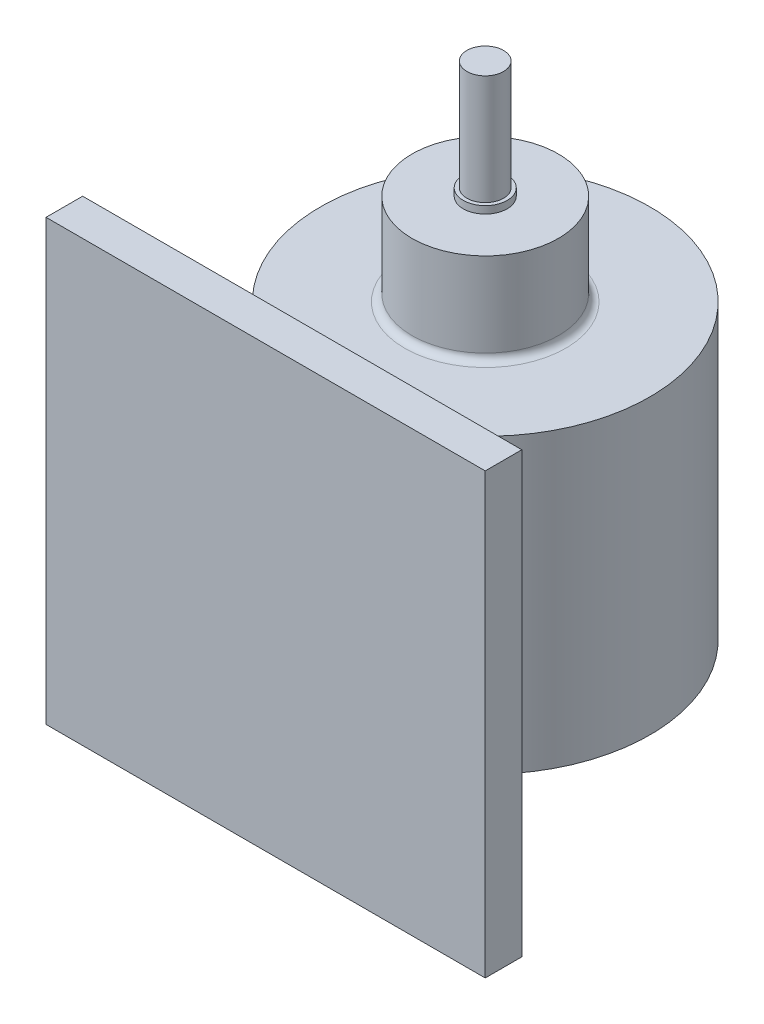
ISO-10303-21;
HEADER;
FILE_DESCRIPTION(('STEP AP214'),'2;1');
FILE_NAME('part.step','',(''),(''),'','','');
FILE_SCHEMA(('AUTOMOTIVE_DESIGN { 1 0 10303 214 1 1 1 1 }'));
ENDSEC;
DATA;
#1=APPLICATION_CONTEXT('core data for automotive mechanical design processes');
#2=APPLICATION_PROTOCOL_DEFINITION('international standard','automotive_design',2000,#1);
#3=PRODUCT_CONTEXT('',#1,'mechanical');
#4=PRODUCT('Part','Part','',(#3));
#5=PRODUCT_RELATED_PRODUCT_CATEGORY('part','',(#4));
#6=PRODUCT_DEFINITION_FORMATION('','',#4);
#7=PRODUCT_DEFINITION_CONTEXT('part definition',#1,'design');
#8=PRODUCT_DEFINITION('design','',#6,#7);
#9=PRODUCT_DEFINITION_SHAPE('','',#8);
#10=(LENGTH_UNIT() NAMED_UNIT(*) SI_UNIT(.MILLI.,.METRE.));
#11=(NAMED_UNIT(*) PLANE_ANGLE_UNIT() SI_UNIT($,.RADIAN.));
#12=(NAMED_UNIT(*) SI_UNIT($,.STERADIAN.) SOLID_ANGLE_UNIT());
#13=UNCERTAINTY_MEASURE_WITH_UNIT(LENGTH_MEASURE(1.E-05),#10,'distance_accuracy_value','');
#14=(GEOMETRIC_REPRESENTATION_CONTEXT(3) GLOBAL_UNCERTAINTY_ASSIGNED_CONTEXT((#13)) GLOBAL_UNIT_ASSIGNED_CONTEXT((#10,
#11,#12)) REPRESENTATION_CONTEXT('',''));
#15=CARTESIAN_POINT('',(0.,0.,0.));
#16=DIRECTION('',(0.,0.,1.));
#17=DIRECTION('',(1.,0.,0.));
#18=AXIS2_PLACEMENT_3D('',#15,#16,#17);
#19=CARTESIAN_POINT('',(0.,40.,-50.));
#20=DIRECTION('',(0.,-1.,0.));
#21=DIRECTION('',(0.,0.,-1.));
#22=AXIS2_PLACEMENT_3D('',#19,#20,#21);
#23=CYLINDRICAL_SURFACE('',#22,45.);
#24=DIRECTION('',(0.,-1.,0.));
#25=VECTOR('',#24,1.);
#26=CARTESIAN_POINT('',(20.,40.,-9.68871125850724));
#27=LINE('',#26,#25);
#28=CARTESIAN_POINT('',(20.,40.,-9.68871125850724));
#29=VERTEX_POINT('',#28);
#30=CARTESIAN_POINT('',(20.,-40.,-9.68871125850724));
#31=VERTEX_POINT('',#30);
#32=EDGE_CURVE('E256',#29,#31,#27,.T.);
#33=ORIENTED_EDGE('',*,*,#32,.F.);
#34=CARTESIAN_POINT('',(0.,40.,-50.));
#35=DIRECTION('',(0.,1.,0.));
#36=DIRECTION('',(0.,0.,1.));
#37=AXIS2_PLACEMENT_3D('',#34,#35,#36);
#38=CIRCLE('',#37,45.);
#39=CARTESIAN_POINT('',(-20.,40.,-9.68871125850724));
#40=VERTEX_POINT('',#39);
#41=EDGE_CURVE('E59',#40,#29,#38,.T.);
#42=ORIENTED_EDGE('',*,*,#41,.F.);
#43=DIRECTION('',(0.,-1.,0.));
#44=VECTOR('',#43,1.);
#45=CARTESIAN_POINT('',(-20.,40.,-9.68871125850724));
#46=LINE('',#45,#44);
#47=CARTESIAN_POINT('',(-20.,-40.,-9.68871125850724));
#48=VERTEX_POINT('',#47);
#49=EDGE_CURVE('E247',#48,#40,#46,.F.);
#50=ORIENTED_EDGE('',*,*,#49,.F.);
#51=CARTESIAN_POINT('',(0.,-40.,-50.));
#52=DIRECTION('',(0.,1.,0.));
#53=DIRECTION('',(0.,0.,1.));
#54=AXIS2_PLACEMENT_3D('',#51,#52,#53);
#55=CIRCLE('',#54,45.);
#56=EDGE_CURVE('E264',#48,#31,#55,.T.);
#57=ORIENTED_EDGE('',*,*,#56,.T.);
#58=EDGE_LOOP('',(#33,#42,#50,#57));
#59=FACE_BOUND('',#58,.T.);
#60=ADVANCED_FACE('F41',(#59),#23,.T.);
#61=DIRECTION('',(0.,-1.,0.));
#62=VECTOR('',#61,1.);
#63=CARTESIAN_POINT('',(30.,40.,-16.4589803375031));
#64=LINE('',#63,#62);
#65=CARTESIAN_POINT('',(30.,-40.,-16.4589803375031));
#66=VERTEX_POINT('',#65);
#67=CARTESIAN_POINT('',(30.,40.,-16.4589803375031));
#68=VERTEX_POINT('',#67);
#69=EDGE_CURVE('E252',#66,#68,#64,.F.);
#70=ORIENTED_EDGE('',*,*,#69,.F.);
#71=CARTESIAN_POINT('',(-30.,-40.,-16.4589803375031));
#72=VERTEX_POINT('',#71);
#73=EDGE_CURVE('E267',#66,#72,#55,.T.);
#74=ORIENTED_EDGE('',*,*,#73,.T.);
#75=DIRECTION('',(0.,-1.,0.));
#76=VECTOR('',#75,1.);
#77=CARTESIAN_POINT('',(-30.,40.,-16.4589803375031));
#78=LINE('',#77,#76);
#79=CARTESIAN_POINT('',(-30.,40.,-16.4589803375031));
#80=VERTEX_POINT('',#79);
#81=EDGE_CURVE('E67',#80,#72,#78,.T.);
#82=ORIENTED_EDGE('',*,*,#81,.F.);
#83=EDGE_CURVE('E142',#68,#80,#38,.T.);
#84=ORIENTED_EDGE('',*,*,#83,.F.);
#85=EDGE_LOOP('',(#70,#74,#82,#84));
#86=FACE_BOUND('',#85,.T.);
#87=ADVANCED_FACE('F279',(#86),#23,.T.);
#88=CARTESIAN_POINT('',(0.,40.,-50.));
#89=DIRECTION('',(0.,1.,0.));
#90=DIRECTION('',(0.,0.,1.));
#91=AXIS2_PLACEMENT_3D('',#88,#89,#90);
#92=PLANE('',#91);
#93=CARTESIAN_POINT('',(0.,40.,-50.));
#94=DIRECTION('',(0.,1.,0.));
#95=DIRECTION('',(0.,0.,1.));
#96=AXIS2_PLACEMENT_3D('',#93,#94,#95);
#97=CIRCLE('',#96,22.);
#98=CARTESIAN_POINT('',(0.,40.,-28.));
#99=VERTEX_POINT('',#98);
#100=EDGE_CURVE('E45',#99,#99,#97,.F.);
#101=ORIENTED_EDGE('',*,*,#100,.T.);
#102=EDGE_LOOP('',(#101));
#103=FACE_BOUND('',#102,.T.);
#104=ORIENTED_EDGE('',*,*,#41,.T.);
#105=DIRECTION('',(0.,0.,1.));
#106=VECTOR('',#105,1.);
#107=CARTESIAN_POINT('',(20.,40.,-50.));
#108=LINE('',#107,#106);
#109=CARTESIAN_POINT('',(20.,40.,0.));
#110=VERTEX_POINT('',#109);
#111=EDGE_CURVE('E202',#29,#110,#108,.T.);
#112=ORIENTED_EDGE('',*,*,#111,.T.);
#113=DIRECTION('',(1.,0.,0.));
#114=VECTOR('',#113,1.);
#115=CARTESIAN_POINT('',(30.,40.,0.));
#116=LINE('',#115,#114);
#117=CARTESIAN_POINT('',(30.,40.,0.));
#118=VERTEX_POINT('',#117);
#119=EDGE_CURVE('E181',#110,#118,#116,.T.);
#120=ORIENTED_EDGE('',*,*,#119,.T.);
#121=DIRECTION('',(0.,0.,1.));
#122=VECTOR('',#121,1.);
#123=CARTESIAN_POINT('',(30.,40.,-50.));
#124=LINE('',#123,#122);
#125=EDGE_CURVE('E199',#68,#118,#124,.T.);
#126=ORIENTED_EDGE('',*,*,#125,.F.);
#127=ORIENTED_EDGE('',*,*,#83,.T.);
#128=DIRECTION('',(0.,0.,1.));
#129=VECTOR('',#128,1.);
#130=CARTESIAN_POINT('',(-30.,40.,-50.));
#131=LINE('',#130,#129);
#132=CARTESIAN_POINT('',(-30.,40.,0.));
#133=VERTEX_POINT('',#132);
#134=EDGE_CURVE('E134',#80,#133,#131,.T.);
#135=ORIENTED_EDGE('',*,*,#134,.T.);
#136=DIRECTION('',(1.,0.,0.));
#137=VECTOR('',#136,1.);
#138=CARTESIAN_POINT('',(-30.,40.,0.));
#139=LINE('',#138,#137);
#140=CARTESIAN_POINT('',(-20.,40.,0.));
#141=VERTEX_POINT('',#140);
#142=EDGE_CURVE('E139',#133,#141,#139,.T.);
#143=ORIENTED_EDGE('',*,*,#142,.T.);
#144=DIRECTION('',(0.,0.,1.));
#145=VECTOR('',#144,1.);
#146=CARTESIAN_POINT('',(-20.,40.,-50.));
#147=LINE('',#146,#145);
#148=EDGE_CURVE('E146',#40,#141,#147,.T.);
#149=ORIENTED_EDGE('',*,*,#148,.F.);
#150=EDGE_LOOP('',(#104,#112,#120,#126,#127,#135,#143,#149));
#151=FACE_BOUND('',#150,.T.);
#152=ADVANCED_FACE('F136',(#103,#151),#92,.T.);
#153=CARTESIAN_POINT('',(0.,-40.,-50.));
#154=DIRECTION('',(0.,1.,0.));
#155=DIRECTION('',(0.,0.,1.));
#156=AXIS2_PLACEMENT_3D('',#153,#154,#155);
#157=PLANE('',#156);
#158=ORIENTED_EDGE('',*,*,#73,.F.);
#159=DIRECTION('',(0.,0.,1.));
#160=VECTOR('',#159,1.);
#161=CARTESIAN_POINT('',(30.,-40.,-50.));
#162=LINE('',#161,#160);
#163=CARTESIAN_POINT('',(30.,-40.,0.));
#164=VERTEX_POINT('',#163);
#165=EDGE_CURVE('E196',#66,#164,#162,.T.);
#166=ORIENTED_EDGE('',*,*,#165,.T.);
#167=DIRECTION('',(-1.,0.,0.));
#168=VECTOR('',#167,1.);
#169=CARTESIAN_POINT('',(30.,-40.,0.));
#170=LINE('',#169,#168);
#171=CARTESIAN_POINT('',(20.,-40.,0.));
#172=VERTEX_POINT('',#171);
#173=EDGE_CURVE('E189',#164,#172,#170,.T.);
#174=ORIENTED_EDGE('',*,*,#173,.T.);
#175=DIRECTION('',(0.,0.,1.));
#176=VECTOR('',#175,1.);
#177=CARTESIAN_POINT('',(20.,-40.,-50.));
#178=LINE('',#177,#176);
#179=EDGE_CURVE('E193',#31,#172,#178,.T.);
#180=ORIENTED_EDGE('',*,*,#179,.F.);
#181=ORIENTED_EDGE('',*,*,#56,.F.);
#182=DIRECTION('',(0.,0.,1.));
#183=VECTOR('',#182,1.);
#184=CARTESIAN_POINT('',(-20.,-40.,-50.));
#185=LINE('',#184,#183);
#186=CARTESIAN_POINT('',(-20.,-40.,0.));
#187=VERTEX_POINT('',#186);
#188=EDGE_CURVE('E173',#48,#187,#185,.T.);
#189=ORIENTED_EDGE('',*,*,#188,.T.);
#190=DIRECTION('',(-1.,0.,0.));
#191=VECTOR('',#190,1.);
#192=CARTESIAN_POINT('',(-30.,-40.,0.));
#193=LINE('',#192,#191);
#194=CARTESIAN_POINT('',(-30.,-40.,0.));
#195=VERTEX_POINT('',#194);
#196=EDGE_CURVE('E165',#187,#195,#193,.T.);
#197=ORIENTED_EDGE('',*,*,#196,.T.);
#198=DIRECTION('',(0.,0.,1.));
#199=VECTOR('',#198,1.);
#200=CARTESIAN_POINT('',(-30.,-40.,-50.));
#201=LINE('',#200,#199);
#202=EDGE_CURVE('E152',#72,#195,#201,.T.);
#203=ORIENTED_EDGE('',*,*,#202,.F.);
#204=EDGE_LOOP('',(#158,#166,#174,#180,#181,#189,#197,#203));
#205=FACE_BOUND('',#204,.T.);
#206=ADVANCED_FACE('F282',(#205),#157,.F.);
#207=CARTESIAN_POINT('',(0.,65.,-50.));
#208=DIRECTION('',(0.,-1.,0.));
#209=DIRECTION('',(0.,0.,-1.));
#210=AXIS2_PLACEMENT_3D('',#207,#208,#209);
#211=CYLINDRICAL_SURFACE('',#210,20.);
#212=CARTESIAN_POINT('',(0.,42.,-50.));
#213=DIRECTION('',(0.,1.,0.));
#214=DIRECTION('',(0.,0.,1.));
#215=AXIS2_PLACEMENT_3D('',#212,#213,#214);
#216=CIRCLE('',#215,20.);
#217=CARTESIAN_POINT('',(0.,42.,-30.));
#218=VERTEX_POINT('',#217);
#219=EDGE_CURVE('E269',#218,#218,#216,.T.);
#220=ORIENTED_EDGE('',*,*,#219,.T.);
#221=EDGE_LOOP('',(#220));
#222=FACE_BOUND('',#221,.T.);
#223=CARTESIAN_POINT('',(0.,65.,-50.));
#224=DIRECTION('',(0.,1.,0.));
#225=DIRECTION('',(0.,0.,1.));
#226=AXIS2_PLACEMENT_3D('',#223,#224,#225);
#227=CIRCLE('',#226,20.);
#228=CARTESIAN_POINT('',(0.,65.,-30.));
#229=VERTEX_POINT('',#228);
#230=EDGE_CURVE('E260',#229,#229,#227,.T.);
#231=ORIENTED_EDGE('',*,*,#230,.F.);
#232=EDGE_LOOP('',(#231));
#233=FACE_BOUND('',#232,.T.);
#234=ADVANCED_FACE('F313',(#222,#233),#211,.T.);
#235=CARTESIAN_POINT('',(0.,65.,-50.));
#236=DIRECTION('',(0.,1.,0.));
#237=DIRECTION('',(0.,0.,1.));
#238=AXIS2_PLACEMENT_3D('',#235,#236,#237);
#239=PLANE('',#238);
#240=CARTESIAN_POINT('',(0.,65.,-50.));
#241=DIRECTION('',(0.,1.,0.));
#242=DIRECTION('',(0.,0.,1.));
#243=AXIS2_PLACEMENT_3D('',#240,#241,#242);
#244=CIRCLE('',#243,6.);
#245=CARTESIAN_POINT('',(0.,65.,-44.));
#246=VERTEX_POINT('',#245);
#247=EDGE_CURVE('E51',#246,#246,#244,.T.);
#248=ORIENTED_EDGE('',*,*,#247,.F.);
#249=EDGE_LOOP('',(#248));
#250=FACE_BOUND('',#249,.T.);
#251=ORIENTED_EDGE('',*,*,#230,.T.);
#252=EDGE_LOOP('',(#251));
#253=FACE_BOUND('',#252,.T.);
#254=ADVANCED_FACE('F304',(#250,#253),#239,.T.);
#255=CARTESIAN_POINT('',(20.,-40.,-50.));
#256=DIRECTION('',(1.,0.,0.));
#257=DIRECTION('',(0.,0.,-1.));
#258=AXIS2_PLACEMENT_3D('',#255,#256,#257);
#259=PLANE('',#258);
#260=ORIENTED_EDGE('',*,*,#111,.F.);
#261=ORIENTED_EDGE('',*,*,#32,.T.);
#262=ORIENTED_EDGE('',*,*,#179,.T.);
#263=DIRECTION('',(0.,1.,0.));
#264=VECTOR('',#263,1.);
#265=CARTESIAN_POINT('',(20.,-40.,0.));
#266=LINE('',#265,#264);
#267=EDGE_CURVE('E145',#172,#110,#266,.T.);
#268=ORIENTED_EDGE('',*,*,#267,.T.);
#269=EDGE_LOOP('',(#260,#261,#262,#268));
#270=FACE_BOUND('',#269,.T.);
#271=ADVANCED_FACE('F289',(#270),#259,.F.);
#272=CARTESIAN_POINT('',(30.,-40.,-50.));
#273=DIRECTION('',(-1.,0.,0.));
#274=DIRECTION('',(0.,0.,1.));
#275=AXIS2_PLACEMENT_3D('',#272,#273,#274);
#276=PLANE('',#275);
#277=ORIENTED_EDGE('',*,*,#165,.F.);
#278=ORIENTED_EDGE('',*,*,#69,.T.);
#279=ORIENTED_EDGE('',*,*,#125,.T.);
#280=DIRECTION('',(0.,-1.,0.));
#281=VECTOR('',#280,1.);
#282=CARTESIAN_POINT('',(30.,-40.,0.));
#283=LINE('',#282,#281);
#284=EDGE_CURVE('E185',#118,#164,#283,.T.);
#285=ORIENTED_EDGE('',*,*,#284,.T.);
#286=EDGE_LOOP('',(#277,#278,#279,#285));
#287=FACE_BOUND('',#286,.T.);
#288=ADVANCED_FACE('F296',(#287),#276,.F.);
#289=CARTESIAN_POINT('',(-30.,-40.,-50.));
#290=DIRECTION('',(1.,0.,0.));
#291=DIRECTION('',(0.,0.,-1.));
#292=AXIS2_PLACEMENT_3D('',#289,#290,#291);
#293=PLANE('',#292);
#294=ORIENTED_EDGE('',*,*,#134,.F.);
#295=ORIENTED_EDGE('',*,*,#81,.T.);
#296=ORIENTED_EDGE('',*,*,#202,.T.);
#297=DIRECTION('',(0.,1.,0.));
#298=VECTOR('',#297,1.);
#299=CARTESIAN_POINT('',(-30.,-40.,0.));
#300=LINE('',#299,#298);
#301=EDGE_CURVE('E149',#195,#133,#300,.T.);
#302=ORIENTED_EDGE('',*,*,#301,.T.);
#303=EDGE_LOOP('',(#294,#295,#296,#302));
#304=FACE_BOUND('',#303,.T.);
#305=ADVANCED_FACE('F150',(#304),#293,.F.);
#306=CARTESIAN_POINT('',(-20.,-40.,-50.));
#307=DIRECTION('',(-1.,0.,0.));
#308=DIRECTION('',(0.,0.,1.));
#309=AXIS2_PLACEMENT_3D('',#306,#307,#308);
#310=PLANE('',#309);
#311=ORIENTED_EDGE('',*,*,#188,.F.);
#312=ORIENTED_EDGE('',*,*,#49,.T.);
#313=ORIENTED_EDGE('',*,*,#148,.T.);
#314=DIRECTION('',(0.,-1.,0.));
#315=VECTOR('',#314,1.);
#316=CARTESIAN_POINT('',(-20.,-40.,0.));
#317=LINE('',#316,#315);
#318=EDGE_CURVE('E161',#141,#187,#317,.T.);
#319=ORIENTED_EDGE('',*,*,#318,.T.);
#320=EDGE_LOOP('',(#311,#312,#313,#319));
#321=FACE_BOUND('',#320,.T.);
#322=ADVANCED_FACE('F286',(#321),#310,.F.);
#323=CARTESIAN_POINT('',(0.,0.,0.));
#324=DIRECTION('',(0.,0.,-1.));
#325=DIRECTION('',(-1.,0.,0.));
#326=AXIS2_PLACEMENT_3D('',#323,#324,#325);
#327=PLANE('',#326);
#328=DIRECTION('',(0.,1.,0.));
#329=VECTOR('',#328,1.);
#330=CARTESIAN_POINT('',(60.,-60.,0.));
#331=LINE('',#330,#329);
#332=CARTESIAN_POINT('',(60.,-60.,0.));
#333=VERTEX_POINT('',#332);
#334=CARTESIAN_POINT('',(60.,60.,0.));
#335=VERTEX_POINT('',#334);
#336=EDGE_CURVE('E205',#333,#335,#331,.T.);
#337=ORIENTED_EDGE('',*,*,#336,.F.);
#338=DIRECTION('',(1.,0.,0.));
#339=VECTOR('',#338,1.);
#340=CARTESIAN_POINT('',(-60.,-60.,0.));
#341=LINE('',#340,#339);
#342=CARTESIAN_POINT('',(-60.,-60.,0.));
#343=VERTEX_POINT('',#342);
#344=EDGE_CURVE('E211',#343,#333,#341,.T.);
#345=ORIENTED_EDGE('',*,*,#344,.F.);
#346=DIRECTION('',(0.,-1.,0.));
#347=VECTOR('',#346,1.);
#348=CARTESIAN_POINT('',(-60.,-60.,0.));
#349=LINE('',#348,#347);
#350=CARTESIAN_POINT('',(-60.,60.,0.));
#351=VERTEX_POINT('',#350);
#352=EDGE_CURVE('E227',#351,#343,#349,.T.);
#353=ORIENTED_EDGE('',*,*,#352,.F.);
#354=DIRECTION('',(-1.,0.,0.));
#355=VECTOR('',#354,1.);
#356=CARTESIAN_POINT('',(-60.,60.,0.));
#357=LINE('',#356,#355);
#358=EDGE_CURVE('E224',#335,#351,#357,.T.);
#359=ORIENTED_EDGE('',*,*,#358,.F.);
#360=EDGE_LOOP('',(#337,#345,#353,#359));
#361=FACE_BOUND('',#360,.T.);
#362=ORIENTED_EDGE('',*,*,#119,.F.);
#363=ORIENTED_EDGE('',*,*,#267,.F.);
#364=ORIENTED_EDGE('',*,*,#173,.F.);
#365=ORIENTED_EDGE('',*,*,#284,.F.);
#366=EDGE_LOOP('',(#362,#363,#364,#365));
#367=FACE_BOUND('',#366,.T.);
#368=ORIENTED_EDGE('',*,*,#142,.F.);
#369=ORIENTED_EDGE('',*,*,#301,.F.);
#370=ORIENTED_EDGE('',*,*,#196,.F.);
#371=ORIENTED_EDGE('',*,*,#318,.F.);
#372=EDGE_LOOP('',(#368,#369,#370,#371));
#373=FACE_BOUND('',#372,.T.);
#374=ADVANCED_FACE('F159',(#361,#367,#373),#327,.T.);
#375=CARTESIAN_POINT('',(60.,-60.,10.));
#376=DIRECTION('',(-1.,0.,0.));
#377=DIRECTION('',(0.,0.,1.));
#378=AXIS2_PLACEMENT_3D('',#375,#376,#377);
#379=PLANE('',#378);
#380=ORIENTED_EDGE('',*,*,#336,.T.);
#381=DIRECTION('',(0.,0.,-1.));
#382=VECTOR('',#381,1.);
#383=CARTESIAN_POINT('',(60.,60.,10.));
#384=LINE('',#383,#382);
#385=CARTESIAN_POINT('',(60.,60.,10.));
#386=VERTEX_POINT('',#385);
#387=EDGE_CURVE('E243',#386,#335,#384,.T.);
#388=ORIENTED_EDGE('',*,*,#387,.F.);
#389=DIRECTION('',(0.,1.,0.));
#390=VECTOR('',#389,1.);
#391=CARTESIAN_POINT('',(60.,-60.,10.));
#392=LINE('',#391,#390);
#393=CARTESIAN_POINT('',(60.,-60.,10.));
#394=VERTEX_POINT('',#393);
#395=EDGE_CURVE('E206',#394,#386,#392,.T.);
#396=ORIENTED_EDGE('',*,*,#395,.F.);
#397=DIRECTION('',(0.,0.,-1.));
#398=VECTOR('',#397,1.);
#399=CARTESIAN_POINT('',(60.,-60.,10.));
#400=LINE('',#399,#398);
#401=EDGE_CURVE('E220',#394,#333,#400,.T.);
#402=ORIENTED_EDGE('',*,*,#401,.T.);
#403=EDGE_LOOP('',(#380,#388,#396,#402));
#404=FACE_BOUND('',#403,.T.);
#405=ADVANCED_FACE('F322',(#404),#379,.F.);
#406=CARTESIAN_POINT('',(-60.,60.,10.));
#407=DIRECTION('',(0.,-1.,0.));
#408=DIRECTION('',(0.,0.,-1.));
#409=AXIS2_PLACEMENT_3D('',#406,#407,#408);
#410=PLANE('',#409);
#411=ORIENTED_EDGE('',*,*,#358,.T.);
#412=DIRECTION('',(0.,0.,-1.));
#413=VECTOR('',#412,1.);
#414=CARTESIAN_POINT('',(-60.,60.,10.));
#415=LINE('',#414,#413);
#416=CARTESIAN_POINT('',(-60.,60.,10.));
#417=VERTEX_POINT('',#416);
#418=EDGE_CURVE('E239',#417,#351,#415,.T.);
#419=ORIENTED_EDGE('',*,*,#418,.F.);
#420=DIRECTION('',(-1.,0.,0.));
#421=VECTOR('',#420,1.);
#422=CARTESIAN_POINT('',(-60.,60.,10.));
#423=LINE('',#422,#421);
#424=EDGE_CURVE('E210',#386,#417,#423,.T.);
#425=ORIENTED_EDGE('',*,*,#424,.F.);
#426=ORIENTED_EDGE('',*,*,#387,.T.);
#427=EDGE_LOOP('',(#411,#419,#425,#426));
#428=FACE_BOUND('',#427,.T.);
#429=ADVANCED_FACE('F325',(#428),#410,.F.);
#430=CARTESIAN_POINT('',(-60.,-60.,10.));
#431=DIRECTION('',(1.,0.,0.));
#432=DIRECTION('',(0.,0.,-1.));
#433=AXIS2_PLACEMENT_3D('',#430,#431,#432);
#434=PLANE('',#433);
#435=ORIENTED_EDGE('',*,*,#352,.T.);
#436=DIRECTION('',(0.,0.,-1.));
#437=VECTOR('',#436,1.);
#438=CARTESIAN_POINT('',(-60.,-60.,10.));
#439=LINE('',#438,#437);
#440=CARTESIAN_POINT('',(-60.,-60.,10.));
#441=VERTEX_POINT('',#440);
#442=EDGE_CURVE('E235',#441,#343,#439,.T.);
#443=ORIENTED_EDGE('',*,*,#442,.F.);
#444=DIRECTION('',(0.,-1.,0.));
#445=VECTOR('',#444,1.);
#446=CARTESIAN_POINT('',(-60.,-60.,10.));
#447=LINE('',#446,#445);
#448=EDGE_CURVE('E214',#417,#441,#447,.T.);
#449=ORIENTED_EDGE('',*,*,#448,.F.);
#450=ORIENTED_EDGE('',*,*,#418,.T.);
#451=EDGE_LOOP('',(#435,#443,#449,#450));
#452=FACE_BOUND('',#451,.T.);
#453=ADVANCED_FACE('F329',(#452),#434,.F.);
#454=CARTESIAN_POINT('',(-60.,-60.,10.));
#455=DIRECTION('',(0.,1.,0.));
#456=DIRECTION('',(0.,0.,1.));
#457=AXIS2_PLACEMENT_3D('',#454,#455,#456);
#458=PLANE('',#457);
#459=ORIENTED_EDGE('',*,*,#344,.T.);
#460=ORIENTED_EDGE('',*,*,#401,.F.);
#461=DIRECTION('',(1.,0.,0.));
#462=VECTOR('',#461,1.);
#463=CARTESIAN_POINT('',(-60.,-60.,10.));
#464=LINE('',#463,#462);
#465=EDGE_CURVE('E217',#441,#394,#464,.T.);
#466=ORIENTED_EDGE('',*,*,#465,.F.);
#467=ORIENTED_EDGE('',*,*,#442,.T.);
#468=EDGE_LOOP('',(#459,#460,#466,#467));
#469=FACE_BOUND('',#468,.T.);
#470=ADVANCED_FACE('F333',(#469),#458,.F.);
#471=CARTESIAN_POINT('',(0.,0.,10.));
#472=DIRECTION('',(0.,0.,-1.));
#473=DIRECTION('',(-1.,0.,0.));
#474=AXIS2_PLACEMENT_3D('',#471,#472,#473);
#475=PLANE('',#474);
#476=ORIENTED_EDGE('',*,*,#395,.T.);
#477=ORIENTED_EDGE('',*,*,#424,.T.);
#478=ORIENTED_EDGE('',*,*,#448,.T.);
#479=ORIENTED_EDGE('',*,*,#465,.T.);
#480=EDGE_LOOP('',(#476,#477,#478,#479));
#481=FACE_BOUND('',#480,.T.);
#482=ADVANCED_FACE('F337',(#481),#475,.F.);
#483=CARTESIAN_POINT('',(0.,42.,-50.));
#484=DIRECTION('',(0.,1.,0.));
#485=DIRECTION('',(0.,0.,1.));
#486=AXIS2_PLACEMENT_3D('',#483,#484,#485);
#487=TOROIDAL_SURFACE('',#486,22.,2.);
#488=ORIENTED_EDGE('',*,*,#100,.F.);
#489=EDGE_LOOP('',(#488));
#490=FACE_BOUND('',#489,.T.);
#491=ORIENTED_EDGE('',*,*,#219,.F.);
#492=EDGE_LOOP('',(#491));
#493=FACE_BOUND('',#492,.T.);
#494=ADVANCED_FACE('F43',(#490,#493),#487,.F.);
#495=CARTESIAN_POINT('',(0.,67.,-50.));
#496=DIRECTION('',(0.,-1.,0.));
#497=DIRECTION('',(0.,0.,-1.));
#498=AXIS2_PLACEMENT_3D('',#495,#496,#497);
#499=CYLINDRICAL_SURFACE('',#498,6.);
#500=CARTESIAN_POINT('',(0.,67.,-50.));
#501=DIRECTION('',(0.,1.,0.));
#502=DIRECTION('',(0.,0.,1.));
#503=AXIS2_PLACEMENT_3D('',#500,#501,#502);
#504=CIRCLE('',#503,6.);
#505=CARTESIAN_POINT('',(0.,67.,-44.));
#506=VERTEX_POINT('',#505);
#507=EDGE_CURVE('E157',#506,#506,#504,.T.);
#508=ORIENTED_EDGE('',*,*,#507,.F.);
#509=EDGE_LOOP('',(#508));
#510=FACE_BOUND('',#509,.T.);
#511=ORIENTED_EDGE('',*,*,#247,.T.);
#512=EDGE_LOOP('',(#511));
#513=FACE_BOUND('',#512,.T.);
#514=ADVANCED_FACE('F347',(#510,#513),#499,.T.);
#515=CARTESIAN_POINT('',(0.,67.,-50.));
#516=DIRECTION('',(0.,1.,0.));
#517=DIRECTION('',(0.,0.,1.));
#518=AXIS2_PLACEMENT_3D('',#515,#516,#517);
#519=PLANE('',#518);
#520=CARTESIAN_POINT('',(0.,67.,-50.));
#521=DIRECTION('',(0.,1.,0.));
#522=DIRECTION('',(0.,0.,1.));
#523=AXIS2_PLACEMENT_3D('',#520,#521,#522);
#524=CIRCLE('',#523,5.);
#525=CARTESIAN_POINT('',(0.,67.,-45.));
#526=VERTEX_POINT('',#525);
#527=EDGE_CURVE('E11',#526,#526,#524,.T.);
#528=ORIENTED_EDGE('',*,*,#527,.F.);
#529=EDGE_LOOP('',(#528));
#530=FACE_BOUND('',#529,.T.);
#531=ORIENTED_EDGE('',*,*,#507,.T.);
#532=EDGE_LOOP('',(#531));
#533=FACE_BOUND('',#532,.T.);
#534=ADVANCED_FACE('F362',(#530,#533),#519,.T.);
#535=CARTESIAN_POINT('',(0.,97.,-50.));
#536=DIRECTION('',(0.,-1.,0.));
#537=DIRECTION('',(0.,0.,-1.));
#538=AXIS2_PLACEMENT_3D('',#535,#536,#537);
#539=CYLINDRICAL_SURFACE('',#538,5.);
#540=CARTESIAN_POINT('',(0.,97.,-50.));
#541=DIRECTION('',(0.,1.,0.));
#542=DIRECTION('',(0.,0.,1.));
#543=AXIS2_PLACEMENT_3D('',#540,#541,#542);
#544=CIRCLE('',#543,5.);
#545=CARTESIAN_POINT('',(0.,97.,-45.));
#546=VERTEX_POINT('',#545);
#547=EDGE_CURVE('E465',#546,#546,#544,.T.);
#548=ORIENTED_EDGE('',*,*,#547,.F.);
#549=EDGE_LOOP('',(#548));
#550=FACE_BOUND('',#549,.T.);
#551=ORIENTED_EDGE('',*,*,#527,.T.);
#552=EDGE_LOOP('',(#551));
#553=FACE_BOUND('',#552,.T.);
#554=ADVANCED_FACE('F370',(#550,#553),#539,.T.);
#555=CARTESIAN_POINT('',(0.,97.,-50.));
#556=DIRECTION('',(0.,1.,0.));
#557=DIRECTION('',(0.,0.,1.));
#558=AXIS2_PLACEMENT_3D('',#555,#556,#557);
#559=PLANE('',#558);
#560=ORIENTED_EDGE('',*,*,#547,.T.);
#561=EDGE_LOOP('',(#560));
#562=FACE_BOUND('',#561,.T.);
#563=ADVANCED_FACE('F450',(#562),#559,.T.);
#564=CLOSED_SHELL('',(#60,#87,#152,#206,#234,#254,#271,#288,#305,#322,#374,#405,#429,#453,#470,
#482,#494,#514,#534,#554,#563));
#565=MANIFOLD_SOLID_BREP('B2',#564);
#566=ADVANCED_BREP_SHAPE_REPRESENTATION('',(#18,#565),#14);
#567=SHAPE_DEFINITION_REPRESENTATION(#9,#566);
ENDSEC;
END-ISO-10303-21;
